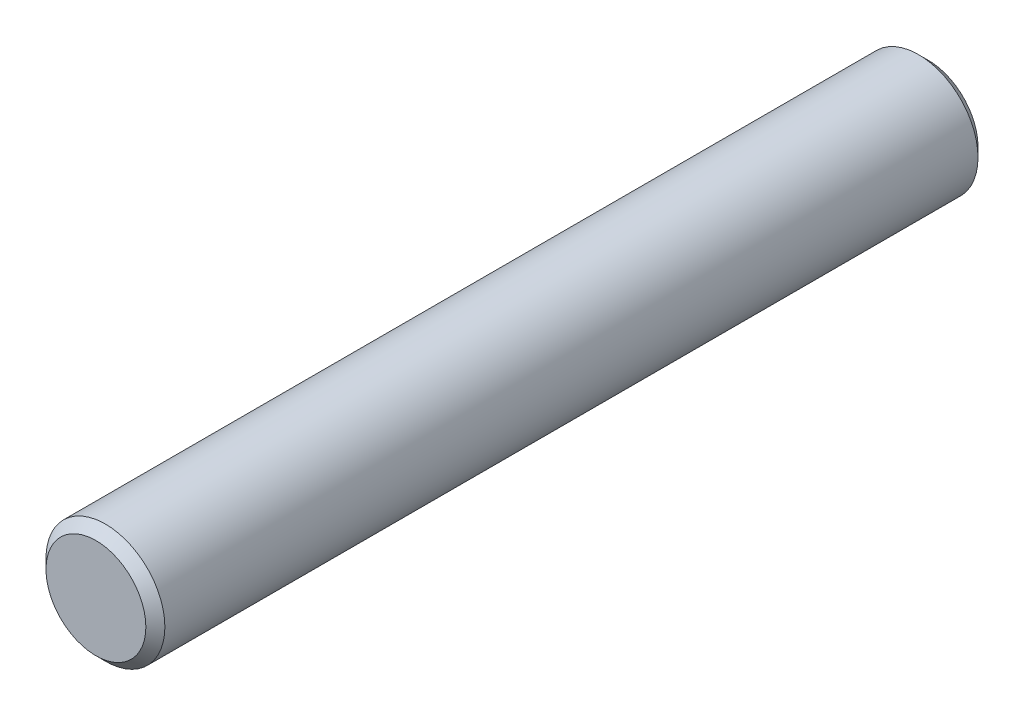
ISO-10303-21;
HEADER;
FILE_DESCRIPTION(('STEP AP214'),'2;1');
FILE_NAME('part.step','',(''),(''),'','','');
FILE_SCHEMA(('AUTOMOTIVE_DESIGN { 1 0 10303 214 1 1 1 1 }'));
ENDSEC;
DATA;
#1=APPLICATION_CONTEXT('core data for automotive mechanical design processes');
#2=APPLICATION_PROTOCOL_DEFINITION('international standard','automotive_design',2000,#1);
#3=PRODUCT_CONTEXT('',#1,'mechanical');
#4=PRODUCT('Part','Part','',(#3));
#5=PRODUCT_RELATED_PRODUCT_CATEGORY('part','',(#4));
#6=PRODUCT_DEFINITION_FORMATION('','',#4);
#7=PRODUCT_DEFINITION_CONTEXT('part definition',#1,'design');
#8=PRODUCT_DEFINITION('design','',#6,#7);
#9=PRODUCT_DEFINITION_SHAPE('','',#8);
#10=(LENGTH_UNIT() NAMED_UNIT(*) SI_UNIT(.MILLI.,.METRE.));
#11=(NAMED_UNIT(*) PLANE_ANGLE_UNIT() SI_UNIT($,.RADIAN.));
#12=(NAMED_UNIT(*) SI_UNIT($,.STERADIAN.) SOLID_ANGLE_UNIT());
#13=UNCERTAINTY_MEASURE_WITH_UNIT(LENGTH_MEASURE(1.E-05),#10,'distance_accuracy_value','');
#14=(GEOMETRIC_REPRESENTATION_CONTEXT(3) GLOBAL_UNCERTAINTY_ASSIGNED_CONTEXT((#13)) GLOBAL_UNIT_ASSIGNED_CONTEXT((#10,
#11,#12)) REPRESENTATION_CONTEXT('',''));
#15=CARTESIAN_POINT('',(0.,0.,0.));
#16=DIRECTION('',(0.,0.,1.));
#17=DIRECTION('',(1.,0.,0.));
#18=AXIS2_PLACEMENT_3D('',#15,#16,#17);
#19=CARTESIAN_POINT('',(0.,0.,-22.225));
#20=DIRECTION('',(0.,0.,1.));
#21=DIRECTION('',(1.,0.,0.));
#22=AXIS2_PLACEMENT_3D('',#19,#20,#21);
#23=CYLINDRICAL_SURFACE('',#22,1.5875);
#24=CARTESIAN_POINT('',(0.,0.,-21.971));
#25=DIRECTION('',(0.,0.,1.));
#26=DIRECTION('',(1.,0.,0.));
#27=AXIS2_PLACEMENT_3D('',#24,#25,#26);
#28=CIRCLE('',#27,1.5875);
#29=CARTESIAN_POINT('',(1.5875,0.,-21.971));
#30=VERTEX_POINT('',#29);
#31=EDGE_CURVE('E59',#30,#30,#28,.T.);
#32=ORIENTED_EDGE('',*,*,#31,.T.);
#33=EDGE_LOOP('',(#32));
#34=FACE_BOUND('',#33,.T.);
#35=CARTESIAN_POINT('',(0.,0.,-0.254000000000001));
#36=DIRECTION('',(0.,0.,1.));
#37=DIRECTION('',(1.,0.,0.));
#38=AXIS2_PLACEMENT_3D('',#35,#36,#37);
#39=CIRCLE('',#38,1.5875);
#40=CARTESIAN_POINT('',(1.5875,0.,-0.254000000000001));
#41=VERTEX_POINT('',#40);
#42=EDGE_CURVE('E66',#41,#41,#39,.F.);
#43=ORIENTED_EDGE('',*,*,#42,.T.);
#44=EDGE_LOOP('',(#43));
#45=FACE_BOUND('',#44,.T.);
#46=ADVANCED_FACE('F43',(#34,#45),#23,.T.);
#47=CARTESIAN_POINT('',(0.,0.,-22.225));
#48=DIRECTION('',(0.,0.,1.));
#49=DIRECTION('',(1.,0.,0.));
#50=AXIS2_PLACEMENT_3D('',#47,#48,#49);
#51=PLANE('',#50);
#52=CARTESIAN_POINT('',(0.,0.,-22.225));
#53=DIRECTION('',(0.,0.,1.));
#54=DIRECTION('',(1.,0.,0.));
#55=AXIS2_PLACEMENT_3D('',#52,#53,#54);
#56=CIRCLE('',#55,1.3335);
#57=CARTESIAN_POINT('',(1.3335,0.,-22.225));
#58=VERTEX_POINT('',#57);
#59=EDGE_CURVE('E52',#58,#58,#56,.F.);
#60=ORIENTED_EDGE('',*,*,#59,.T.);
#61=EDGE_LOOP('',(#60));
#62=FACE_BOUND('',#61,.T.);
#63=ADVANCED_FACE('F85',(#62),#51,.F.);
#64=CARTESIAN_POINT('',(0.,0.,0.));
#65=DIRECTION('',(0.,0.,1.));
#66=DIRECTION('',(1.,0.,0.));
#67=AXIS2_PLACEMENT_3D('',#64,#65,#66);
#68=PLANE('',#67);
#69=CARTESIAN_POINT('',(0.,0.,0.));
#70=DIRECTION('',(0.,0.,1.));
#71=DIRECTION('',(1.,0.,0.));
#72=AXIS2_PLACEMENT_3D('',#69,#70,#71);
#73=CIRCLE('',#72,1.3335);
#74=CARTESIAN_POINT('',(1.3335,0.,0.));
#75=VERTEX_POINT('',#74);
#76=EDGE_CURVE('E10',#75,#75,#73,.T.);
#77=ORIENTED_EDGE('',*,*,#76,.T.);
#78=EDGE_LOOP('',(#77));
#79=FACE_BOUND('',#78,.T.);
#80=ADVANCED_FACE('F82',(#79),#68,.T.);
#81=CARTESIAN_POINT('',(0.,0.,-21.971));
#82=DIRECTION('',(0.,0.,1.));
#83=DIRECTION('',(1.,0.,0.));
#84=AXIS2_PLACEMENT_3D('',#81,#82,#83);
#85=CONICAL_SURFACE('',#84,1.5875,0.785398163397447);
#86=ORIENTED_EDGE('',*,*,#59,.F.);
#87=EDGE_LOOP('',(#86));
#88=FACE_BOUND('',#87,.T.);
#89=ORIENTED_EDGE('',*,*,#31,.F.);
#90=EDGE_LOOP('',(#89));
#91=FACE_BOUND('',#90,.T.);
#92=ADVANCED_FACE('F78',(#88,#91),#85,.T.);
#93=CARTESIAN_POINT('',(0.,0.,0.));
#94=DIRECTION('',(0.,0.,-1.));
#95=DIRECTION('',(-1.,0.,0.));
#96=AXIS2_PLACEMENT_3D('',#93,#94,#95);
#97=CONICAL_SURFACE('',#96,1.3335,0.785398163397444);
#98=ORIENTED_EDGE('',*,*,#42,.F.);
#99=EDGE_LOOP('',(#98));
#100=FACE_BOUND('',#99,.T.);
#101=ORIENTED_EDGE('',*,*,#76,.F.);
#102=EDGE_LOOP('',(#101));
#103=FACE_BOUND('',#102,.T.);
#104=ADVANCED_FACE('F46',(#100,#103),#97,.T.);
#105=CLOSED_SHELL('',(#46,#63,#80,#92,#104));
#106=MANIFOLD_SOLID_BREP('B2',#105);
#107=ADVANCED_BREP_SHAPE_REPRESENTATION('',(#18,#106),#14);
#108=SHAPE_DEFINITION_REPRESENTATION(#9,#107);
ENDSEC;
END-ISO-10303-21;
